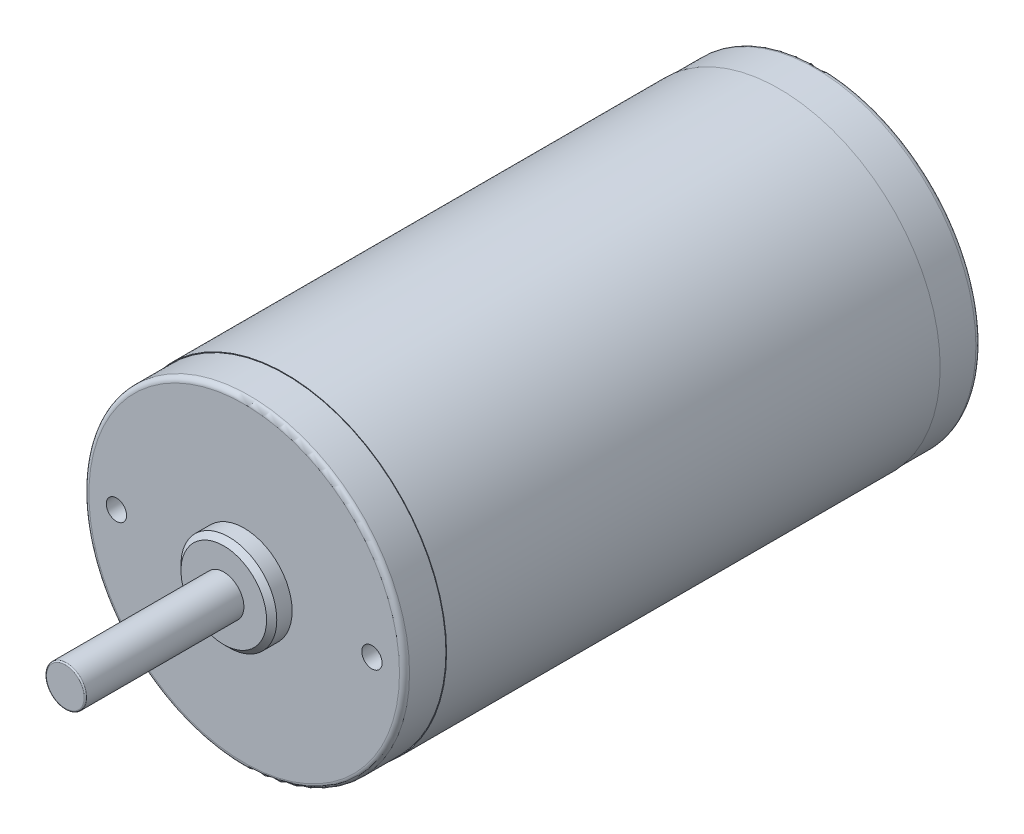
ISO-10303-21;
HEADER;
FILE_DESCRIPTION(('STEP AP214'),'2;1');
FILE_NAME('part.step','',(''),(''),'','','');
FILE_SCHEMA(('AUTOMOTIVE_DESIGN { 1 0 10303 214 1 1 1 1 }'));
ENDSEC;
DATA;
#1=APPLICATION_CONTEXT('core data for automotive mechanical design processes');
#2=APPLICATION_PROTOCOL_DEFINITION('international standard','automotive_design',2000,#1);
#3=PRODUCT_CONTEXT('',#1,'mechanical');
#4=PRODUCT('Part','Part','',(#3));
#5=PRODUCT_RELATED_PRODUCT_CATEGORY('part','',(#4));
#6=PRODUCT_DEFINITION_FORMATION('','',#4);
#7=PRODUCT_DEFINITION_CONTEXT('part definition',#1,'design');
#8=PRODUCT_DEFINITION('design','',#6,#7);
#9=PRODUCT_DEFINITION_SHAPE('','',#8);
#10=(LENGTH_UNIT() NAMED_UNIT(*) SI_UNIT(.MILLI.,.METRE.));
#11=(NAMED_UNIT(*) PLANE_ANGLE_UNIT() SI_UNIT($,.RADIAN.));
#12=(NAMED_UNIT(*) SI_UNIT($,.STERADIAN.) SOLID_ANGLE_UNIT());
#13=UNCERTAINTY_MEASURE_WITH_UNIT(LENGTH_MEASURE(1.E-05),#10,'distance_accuracy_value','');
#14=(GEOMETRIC_REPRESENTATION_CONTEXT(3) GLOBAL_UNCERTAINTY_ASSIGNED_CONTEXT((#13)) GLOBAL_UNIT_ASSIGNED_CONTEXT((#10,
#11,#12)) REPRESENTATION_CONTEXT('',''));
#15=CARTESIAN_POINT('',(0.,0.,0.));
#16=DIRECTION('',(0.,0.,1.));
#17=DIRECTION('',(1.,0.,0.));
#18=AXIS2_PLACEMENT_3D('',#15,#16,#17);
#19=CARTESIAN_POINT('',(35.56,109.2962,-95.554799999998));
#20=DIRECTION('',(0.,0.,-1.));
#21=DIRECTION('',(-1.,0.,0.));
#22=AXIS2_PLACEMENT_3D('',#19,#20,#21);
#23=PLANE('',#22);
#24=CARTESIAN_POINT('',(35.56,109.2962,-95.554799999998));
#25=DIRECTION('',(0.,0.,-1.));
#26=DIRECTION('',(-1.,0.,0.));
#27=AXIS2_PLACEMENT_3D('',#24,#25,#26);
#28=CIRCLE('',#27,30.8770000000005);
#29=CARTESIAN_POINT('',(4.6829999999995,109.2962,-95.554799999998));
#30=VERTEX_POINT('',#29);
#31=EDGE_CURVE('E102',#30,#30,#28,.T.);
#32=ORIENTED_EDGE('',*,*,#31,.T.);
#33=EDGE_LOOP('',(#32));
#34=FACE_BOUND('',#33,.T.);
#35=CARTESIAN_POINT('',(35.56,109.2962,-95.554799999998));
#36=DIRECTION('',(0.,0.,-1.));
#37=DIRECTION('',(-1.,0.,0.));
#38=AXIS2_PLACEMENT_3D('',#35,#36,#37);
#39=CIRCLE('',#38,15.0368000000003);
#40=CARTESIAN_POINT('',(20.5231999999997,109.2962,-95.554799999998));
#41=VERTEX_POINT('',#40);
#42=EDGE_CURVE('E69',#41,#41,#39,.T.);
#43=ORIENTED_EDGE('',*,*,#42,.F.);
#44=EDGE_LOOP('',(#43));
#45=FACE_BOUND('',#44,.T.);
#46=ADVANCED_FACE('F34',(#34,#45),#23,.T.);
#47=CARTESIAN_POINT('',(35.56,109.2962,-87.325199999998));
#48=DIRECTION('',(0.,0.,-1.));
#49=DIRECTION('',(-1.,0.,0.));
#50=AXIS2_PLACEMENT_3D('',#47,#48,#49);
#51=PLANE('',#50);
#52=CARTESIAN_POINT('',(35.56,109.2962,-87.325199999998));
#53=DIRECTION('',(0.,0.,-1.));
#54=DIRECTION('',(-1.,0.,0.));
#55=AXIS2_PLACEMENT_3D('',#52,#53,#54);
#56=CIRCLE('',#55,32.0040000000005);
#57=CARTESIAN_POINT('',(3.5559999999995,109.2962,-87.325199999998));
#58=VERTEX_POINT('',#57);
#59=EDGE_CURVE('E81',#58,#58,#56,.T.);
#60=ORIENTED_EDGE('',*,*,#59,.T.);
#61=EDGE_LOOP('',(#60));
#62=FACE_BOUND('',#61,.T.);
#63=CARTESIAN_POINT('',(35.56,109.2962,-87.325199999998));
#64=DIRECTION('',(0.,0.,-1.));
#65=DIRECTION('',(-1.,0.,0.));
#66=AXIS2_PLACEMENT_3D('',#63,#64,#65);
#67=CIRCLE('',#66,31.8770000000005);
#68=CARTESIAN_POINT('',(3.6829999999995,109.2962,-87.325199999998));
#69=VERTEX_POINT('',#68);
#70=EDGE_CURVE('E72',#69,#69,#67,.T.);
#71=ORIENTED_EDGE('',*,*,#70,.F.);
#72=EDGE_LOOP('',(#71));
#73=FACE_BOUND('',#72,.T.);
#74=ADVANCED_FACE('F128',(#62,#73),#51,.T.);
#75=CARTESIAN_POINT('',(35.56,109.2962,23.114));
#76=DIRECTION('',(0.,0.,1.));
#77=DIRECTION('',(1.,0.,0.));
#78=AXIS2_PLACEMENT_3D('',#75,#76,#77);
#79=PLANE('',#78);
#80=CARTESIAN_POINT('',(35.56,109.2962,23.114));
#81=DIRECTION('',(0.,0.,1.));
#82=DIRECTION('',(1.,0.,0.));
#83=AXIS2_PLACEMENT_3D('',#80,#81,#82);
#84=CIRCLE('',#83,8.50900000182338);
#85=CARTESIAN_POINT('',(44.0690000018234,109.2962,23.114));
#86=VERTEX_POINT('',#85);
#87=EDGE_CURVE('E93',#86,#86,#84,.T.);
#88=ORIENTED_EDGE('',*,*,#87,.T.);
#89=EDGE_LOOP('',(#88));
#90=FACE_BOUND('',#89,.T.);
#91=CARTESIAN_POINT('',(35.56,109.2962,23.114));
#92=DIRECTION('',(0.,0.,1.));
#93=DIRECTION('',(1.,0.,0.));
#94=AXIS2_PLACEMENT_3D('',#91,#92,#93);
#95=CIRCLE('',#94,4.00000000000007);
#96=CARTESIAN_POINT('',(39.5600000000001,109.2962,23.114));
#97=VERTEX_POINT('',#96);
#98=EDGE_CURVE('E75',#97,#97,#95,.T.);
#99=ORIENTED_EDGE('',*,*,#98,.F.);
#100=EDGE_LOOP('',(#99));
#101=FACE_BOUND('',#100,.T.);
#102=ADVANCED_FACE('F134',(#90,#101),#79,.T.);
#103=CARTESIAN_POINT('',(67.5640000000005,109.2962,10.8204000000007));
#104=DIRECTION('',(0.,0.,1.));
#105=DIRECTION('',(1.,0.,0.));
#106=AXIS2_PLACEMENT_3D('',#103,#104,#105);
#107=PLANE('',#106);
#108=CARTESIAN_POINT('',(35.56,109.2962,10.8204000000007));
#109=DIRECTION('',(0.,0.,-1.));
#110=DIRECTION('',(-1.,0.,0.));
#111=AXIS2_PLACEMENT_3D('',#108,#109,#110);
#112=CIRCLE('',#111,32.0040000000005);
#113=CARTESIAN_POINT('',(3.5559999999995,109.2962,10.8204000000007));
#114=VERTEX_POINT('',#113);
#115=EDGE_CURVE('E84',#114,#114,#112,.T.);
#116=ORIENTED_EDGE('',*,*,#115,.F.);
#117=EDGE_LOOP('',(#116));
#118=FACE_BOUND('',#117,.T.);
#119=CARTESIAN_POINT('',(35.56,109.2962,10.8204000000007));
#120=DIRECTION('',(0.,0.,1.));
#121=DIRECTION('',(1.,0.,0.));
#122=AXIS2_PLACEMENT_3D('',#119,#120,#121);
#123=CIRCLE('',#122,31.8770000000005);
#124=CARTESIAN_POINT('',(67.4370000000005,109.2962,10.8204000000007));
#125=VERTEX_POINT('',#124);
#126=EDGE_CURVE('E78',#125,#125,#123,.T.);
#127=ORIENTED_EDGE('',*,*,#126,.F.);
#128=EDGE_LOOP('',(#127));
#129=FACE_BOUND('',#128,.T.);
#130=ADVANCED_FACE('F157',(#118,#129),#107,.T.);
#131=CARTESIAN_POINT('',(35.56,109.2962,10.8204000000007));
#132=DIRECTION('',(0.,0.,-1.));
#133=DIRECTION('',(-1.,0.,0.));
#134=AXIS2_PLACEMENT_3D('',#131,#132,#133);
#135=CYLINDRICAL_SURFACE('',#134,32.0040000000005);
#136=ORIENTED_EDGE('',*,*,#115,.T.);
#137=EDGE_LOOP('',(#136));
#138=FACE_BOUND('',#137,.T.);
#139=ORIENTED_EDGE('',*,*,#59,.F.);
#140=EDGE_LOOP('',(#139));
#141=FACE_BOUND('',#140,.T.);
#142=ADVANCED_FACE('F168',(#138,#141),#135,.T.);
#143=CARTESIAN_POINT('',(35.56,109.2962,19.05));
#144=DIRECTION('',(0.,0.,-1.));
#145=DIRECTION('',(-1.,0.,0.));
#146=AXIS2_PLACEMENT_3D('',#143,#144,#145);
#147=CYLINDRICAL_SURFACE('',#146,31.8770000000005);
#148=CARTESIAN_POINT('',(35.56,109.2962,18.05));
#149=DIRECTION('',(0.,0.,1.));
#150=DIRECTION('',(1.,0.,0.));
#151=AXIS2_PLACEMENT_3D('',#148,#149,#150);
#152=CIRCLE('',#151,31.8770000000005);
#153=CARTESIAN_POINT('',(67.4370000000005,109.2962,18.05));
#154=VERTEX_POINT('',#153);
#155=EDGE_CURVE('E111',#154,#154,#152,.F.);
#156=ORIENTED_EDGE('',*,*,#155,.T.);
#157=EDGE_LOOP('',(#156));
#158=FACE_BOUND('',#157,.T.);
#159=ORIENTED_EDGE('',*,*,#126,.T.);
#160=EDGE_LOOP('',(#159));
#161=FACE_BOUND('',#160,.T.);
#162=ADVANCED_FACE('F165',(#158,#161),#147,.T.);
#163=CARTESIAN_POINT('',(35.56,109.2962,19.05));
#164=DIRECTION('',(0.,0.,1.));
#165=DIRECTION('',(1.,0.,0.));
#166=AXIS2_PLACEMENT_3D('',#163,#164,#165);
#167=PLANE('',#166);
#168=CARTESIAN_POINT('',(35.56,109.2962,19.05));
#169=DIRECTION('',(0.,0.,1.));
#170=DIRECTION('',(1.,0.,0.));
#171=AXIS2_PLACEMENT_3D('',#168,#169,#170);
#172=CIRCLE('',#171,30.8770000000005);
#173=CARTESIAN_POINT('',(66.4370000000005,109.2962,19.05));
#174=VERTEX_POINT('',#173);
#175=EDGE_CURVE('E108',#174,#174,#172,.T.);
#176=ORIENTED_EDGE('',*,*,#175,.T.);
#177=EDGE_LOOP('',(#176));
#178=FACE_BOUND('',#177,.T.);
#179=CARTESIAN_POINT('',(10.1599999999994,109.2962,19.05));
#180=DIRECTION('',(0.,0.,1.));
#181=DIRECTION('',(1.,0.,0.));
#182=AXIS2_PLACEMENT_3D('',#179,#180,#181);
#183=CIRCLE('',#182,2.01930000000003);
#184=CARTESIAN_POINT('',(12.1792999999994,109.2962,19.05));
#185=VERTEX_POINT('',#184);
#186=EDGE_CURVE('E59',#185,#185,#183,.T.);
#187=ORIENTED_EDGE('',*,*,#186,.F.);
#188=EDGE_LOOP('',(#187));
#189=FACE_BOUND('',#188,.T.);
#190=CARTESIAN_POINT('',(60.96,109.2962,19.05));
#191=DIRECTION('',(0.,0.,1.));
#192=DIRECTION('',(1.,0.,0.));
#193=AXIS2_PLACEMENT_3D('',#190,#191,#192);
#194=CIRCLE('',#193,2.01930000000003);
#195=CARTESIAN_POINT('',(62.9793,109.2962,19.05));
#196=VERTEX_POINT('',#195);
#197=EDGE_CURVE('E58',#196,#196,#194,.T.);
#198=ORIENTED_EDGE('',*,*,#197,.F.);
#199=EDGE_LOOP('',(#198));
#200=FACE_BOUND('',#199,.T.);
#201=CARTESIAN_POINT('',(35.56,109.2962,19.05));
#202=DIRECTION('',(0.,0.,1.));
#203=DIRECTION('',(1.,0.,0.));
#204=AXIS2_PLACEMENT_3D('',#201,#202,#203);
#205=CIRCLE('',#204,9.52500000000019);
#206=CARTESIAN_POINT('',(45.0850000000002,109.2962,19.05));
#207=VERTEX_POINT('',#206);
#208=EDGE_CURVE('E87',#207,#207,#205,.T.);
#209=ORIENTED_EDGE('',*,*,#208,.F.);
#210=EDGE_LOOP('',(#209));
#211=FACE_BOUND('',#210,.T.);
#212=ADVANCED_FACE('F161',(#178,#189,#200,#211),#167,.T.);
#213=CARTESIAN_POINT('',(35.56,109.2962,23.114));
#214=DIRECTION('',(0.,0.,-1.));
#215=DIRECTION('',(-1.,0.,0.));
#216=AXIS2_PLACEMENT_3D('',#213,#214,#215);
#217=CYLINDRICAL_SURFACE('',#216,9.52500000000019);
#218=CARTESIAN_POINT('',(35.56,109.2962,22.0979999999996));
#219=DIRECTION('',(0.,0.,1.));
#220=DIRECTION('',(1.,0.,0.));
#221=AXIS2_PLACEMENT_3D('',#218,#219,#220);
#222=CIRCLE('',#221,9.52500000000019);
#223=CARTESIAN_POINT('',(45.0850000000002,109.2962,22.0979999999996));
#224=VERTEX_POINT('',#223);
#225=EDGE_CURVE('E90',#224,#224,#222,.F.);
#226=ORIENTED_EDGE('',*,*,#225,.T.);
#227=EDGE_LOOP('',(#226));
#228=FACE_BOUND('',#227,.T.);
#229=ORIENTED_EDGE('',*,*,#208,.T.);
#230=EDGE_LOOP('',(#229));
#231=FACE_BOUND('',#230,.T.);
#232=ADVANCED_FACE('F153',(#228,#231),#217,.T.);
#233=CARTESIAN_POINT('',(35.56,109.2962,54.614));
#234=DIRECTION('',(0.,0.,-1.));
#235=DIRECTION('',(-1.,0.,0.));
#236=AXIS2_PLACEMENT_3D('',#233,#234,#235);
#237=CYLINDRICAL_SURFACE('',#236,4.00000000000007);
#238=CARTESIAN_POINT('',(35.56,109.2962,54.36));
#239=DIRECTION('',(0.,0.,1.));
#240=DIRECTION('',(1.,0.,0.));
#241=AXIS2_PLACEMENT_3D('',#238,#239,#240);
#242=CIRCLE('',#241,4.00000000000007);
#243=CARTESIAN_POINT('',(39.5600000000001,109.2962,54.36));
#244=VERTEX_POINT('',#243);
#245=EDGE_CURVE('E99',#244,#244,#242,.F.);
#246=ORIENTED_EDGE('',*,*,#245,.T.);
#247=EDGE_LOOP('',(#246));
#248=FACE_BOUND('',#247,.T.);
#249=ORIENTED_EDGE('',*,*,#98,.T.);
#250=EDGE_LOOP('',(#249));
#251=FACE_BOUND('',#250,.T.);
#252=ADVANCED_FACE('F149',(#248,#251),#237,.T.);
#253=CARTESIAN_POINT('',(35.56,109.2962,54.614));
#254=DIRECTION('',(0.,0.,1.));
#255=DIRECTION('',(1.,0.,0.));
#256=AXIS2_PLACEMENT_3D('',#253,#254,#255);
#257=PLANE('',#256);
#258=CARTESIAN_POINT('',(35.56,109.2962,54.614));
#259=DIRECTION('',(0.,0.,1.));
#260=DIRECTION('',(1.,0.,0.));
#261=AXIS2_PLACEMENT_3D('',#258,#259,#260);
#262=CIRCLE('',#261,3.74600000000007);
#263=CARTESIAN_POINT('',(39.3060000000001,109.2962,54.614));
#264=VERTEX_POINT('',#263);
#265=EDGE_CURVE('E96',#264,#264,#262,.T.);
#266=ORIENTED_EDGE('',*,*,#265,.T.);
#267=EDGE_LOOP('',(#266));
#268=FACE_BOUND('',#267,.T.);
#269=ADVANCED_FACE('F145',(#268),#257,.T.);
#270=CARTESIAN_POINT('',(35.56,109.2962,-95.554799999998));
#271=DIRECTION('',(0.,0.,1.));
#272=DIRECTION('',(1.,0.,0.));
#273=AXIS2_PLACEMENT_3D('',#270,#271,#272);
#274=CYLINDRICAL_SURFACE('',#273,31.8770000000005);
#275=CARTESIAN_POINT('',(35.56,109.2962,-94.554799999998));
#276=DIRECTION('',(0.,0.,-1.));
#277=DIRECTION('',(-1.,0.,0.));
#278=AXIS2_PLACEMENT_3D('',#275,#276,#277);
#279=CIRCLE('',#278,31.8770000000005);
#280=CARTESIAN_POINT('',(3.6829999999995,109.2962,-94.554799999998));
#281=VERTEX_POINT('',#280);
#282=EDGE_CURVE('E105',#281,#281,#279,.F.);
#283=ORIENTED_EDGE('',*,*,#282,.T.);
#284=EDGE_LOOP('',(#283));
#285=FACE_BOUND('',#284,.T.);
#286=ORIENTED_EDGE('',*,*,#70,.T.);
#287=EDGE_LOOP('',(#286));
#288=FACE_BOUND('',#287,.T.);
#289=ADVANCED_FACE('F142',(#285,#288),#274,.T.);
#290=CARTESIAN_POINT('',(35.56,109.2962,-100.317299999998));
#291=DIRECTION('',(0.,0.,1.));
#292=DIRECTION('',(1.,0.,0.));
#293=AXIS2_PLACEMENT_3D('',#290,#291,#292);
#294=CYLINDRICAL_SURFACE('',#293,15.0368000000003);
#295=CARTESIAN_POINT('',(35.56,109.2962,-99.317299999998));
#296=DIRECTION('',(0.,0.,-1.));
#297=DIRECTION('',(-1.,0.,0.));
#298=AXIS2_PLACEMENT_3D('',#295,#296,#297);
#299=CIRCLE('',#298,15.0368000000003);
#300=CARTESIAN_POINT('',(20.5231999999997,109.2962,-99.317299999998));
#301=VERTEX_POINT('',#300);
#302=EDGE_CURVE('E11',#301,#301,#299,.F.);
#303=ORIENTED_EDGE('',*,*,#302,.T.);
#304=EDGE_LOOP('',(#303));
#305=FACE_BOUND('',#304,.T.);
#306=ORIENTED_EDGE('',*,*,#42,.T.);
#307=EDGE_LOOP('',(#306));
#308=FACE_BOUND('',#307,.T.);
#309=ADVANCED_FACE('F140',(#305,#308),#294,.T.);
#310=CARTESIAN_POINT('',(35.56,109.2962,-100.317299999998));
#311=DIRECTION('',(0.,0.,-1.));
#312=DIRECTION('',(-1.,0.,0.));
#313=AXIS2_PLACEMENT_3D('',#310,#311,#312);
#314=PLANE('',#313);
#315=CARTESIAN_POINT('',(35.56,109.2962,-100.317299999998));
#316=DIRECTION('',(0.,0.,-1.));
#317=DIRECTION('',(-1.,0.,0.));
#318=AXIS2_PLACEMENT_3D('',#315,#316,#317);
#319=CIRCLE('',#318,14.0368000000003);
#320=CARTESIAN_POINT('',(21.5231999999997,109.2962,-100.317299999998));
#321=VERTEX_POINT('',#320);
#322=EDGE_CURVE('E42',#321,#321,#319,.T.);
#323=ORIENTED_EDGE('',*,*,#322,.T.);
#324=EDGE_LOOP('',(#323));
#325=FACE_BOUND('',#324,.T.);
#326=ADVANCED_FACE('F116',(#325),#314,.T.);
#327=CARTESIAN_POINT('',(60.96,109.2962,5.43560000000074));
#328=DIRECTION('',(0.,0.,1.));
#329=DIRECTION('',(1.,0.,0.));
#330=AXIS2_PLACEMENT_3D('',#327,#328,#329);
#331=CONICAL_SURFACE('',#330,2.01930000000003,1.0297442575);
#332=CARTESIAN_POINT('',(60.96,109.2962,4.22228214876452));
#333=VERTEX_POINT('',#332);
#334=VERTEX_LOOP('',#333);
#335=FACE_BOUND('',#334,.T.);
#336=CARTESIAN_POINT('',(60.96,109.2962,5.43560000000074));
#337=DIRECTION('',(0.,0.,1.));
#338=DIRECTION('',(1.,0.,0.));
#339=AXIS2_PLACEMENT_3D('',#336,#337,#338);
#340=CIRCLE('',#339,2.01930000000003);
#341=CARTESIAN_POINT('',(62.9793,109.2962,5.43560000000074));
#342=VERTEX_POINT('',#341);
#343=EDGE_CURVE('E62',#342,#342,#340,.T.);
#344=ORIENTED_EDGE('',*,*,#343,.T.);
#345=EDGE_LOOP('',(#344));
#346=FACE_BOUND('',#345,.T.);
#347=ADVANCED_FACE('F232',(#335,#346),#331,.F.);
#348=CARTESIAN_POINT('',(60.96,109.2962,19.05));
#349=DIRECTION('',(0.,0.,1.));
#350=DIRECTION('',(1.,0.,0.));
#351=AXIS2_PLACEMENT_3D('',#348,#349,#350);
#352=CYLINDRICAL_SURFACE('',#351,2.01930000000003);
#353=ORIENTED_EDGE('',*,*,#343,.F.);
#354=EDGE_LOOP('',(#353));
#355=FACE_BOUND('',#354,.T.);
#356=ORIENTED_EDGE('',*,*,#197,.T.);
#357=EDGE_LOOP('',(#356));
#358=FACE_BOUND('',#357,.T.);
#359=ADVANCED_FACE('F52',(#355,#358),#352,.F.);
#360=CARTESIAN_POINT('',(10.1599999999994,109.2962,5.4356000000007));
#361=DIRECTION('',(0.,0.,1.));
#362=DIRECTION('',(1.,0.,0.));
#363=AXIS2_PLACEMENT_3D('',#360,#361,#362);
#364=CONICAL_SURFACE('',#363,2.01930000000003,1.0297442575);
#365=CARTESIAN_POINT('',(10.1599999999994,109.2962,4.22228214876447));
#366=VERTEX_POINT('',#365);
#367=VERTEX_LOOP('',#366);
#368=FACE_BOUND('',#367,.T.);
#369=CARTESIAN_POINT('',(10.1599999999994,109.2962,5.4356000000007));
#370=DIRECTION('',(0.,0.,1.));
#371=DIRECTION('',(1.,0.,0.));
#372=AXIS2_PLACEMENT_3D('',#369,#370,#371);
#373=CIRCLE('',#372,2.01930000000003);
#374=CARTESIAN_POINT('',(12.1792999999994,109.2962,5.4356000000007));
#375=VERTEX_POINT('',#374);
#376=EDGE_CURVE('E56',#375,#375,#373,.T.);
#377=ORIENTED_EDGE('',*,*,#376,.T.);
#378=EDGE_LOOP('',(#377));
#379=FACE_BOUND('',#378,.T.);
#380=ADVANCED_FACE('F48',(#368,#379),#364,.F.);
#381=CARTESIAN_POINT('',(10.1599999999994,109.2962,19.05));
#382=DIRECTION('',(0.,0.,1.));
#383=DIRECTION('',(1.,0.,0.));
#384=AXIS2_PLACEMENT_3D('',#381,#382,#383);
#385=CYLINDRICAL_SURFACE('',#384,2.01930000000003);
#386=ORIENTED_EDGE('',*,*,#376,.F.);
#387=EDGE_LOOP('',(#386));
#388=FACE_BOUND('',#387,.T.);
#389=ORIENTED_EDGE('',*,*,#186,.T.);
#390=EDGE_LOOP('',(#389));
#391=FACE_BOUND('',#390,.T.);
#392=ADVANCED_FACE('F51',(#388,#391),#385,.F.);
#393=CARTESIAN_POINT('',(35.56,109.2962,22.0979999999996));
#394=DIRECTION('',(0.,0.,-1.));
#395=DIRECTION('',(-1.,0.,0.));
#396=AXIS2_PLACEMENT_3D('',#393,#394,#395);
#397=CONICAL_SURFACE('',#396,9.52500000000019,0.785398162500005);
#398=ORIENTED_EDGE('',*,*,#87,.F.);
#399=EDGE_LOOP('',(#398));
#400=FACE_BOUND('',#399,.T.);
#401=ORIENTED_EDGE('',*,*,#225,.F.);
#402=EDGE_LOOP('',(#401));
#403=FACE_BOUND('',#402,.T.);
#404=ADVANCED_FACE('F177',(#400,#403),#397,.T.);
#405=CARTESIAN_POINT('',(35.56,109.2962,54.36));
#406=DIRECTION('',(0.,0.,1.));
#407=DIRECTION('',(1.,0.,0.));
#408=AXIS2_PLACEMENT_3D('',#405,#406,#407);
#409=TOROIDAL_SURFACE('',#408,3.74600000000007,0.254);
#410=ORIENTED_EDGE('',*,*,#245,.F.);
#411=EDGE_LOOP('',(#410));
#412=FACE_BOUND('',#411,.T.);
#413=ORIENTED_EDGE('',*,*,#265,.F.);
#414=EDGE_LOOP('',(#413));
#415=FACE_BOUND('',#414,.T.);
#416=ADVANCED_FACE('F180',(#412,#415),#409,.T.);
#417=CARTESIAN_POINT('',(35.56,109.2962,-94.554799999998));
#418=DIRECTION('',(0.,0.,-1.));
#419=DIRECTION('',(-1.,0.,0.));
#420=AXIS2_PLACEMENT_3D('',#417,#418,#419);
#421=TOROIDAL_SURFACE('',#420,30.8770000000005,1.);
#422=ORIENTED_EDGE('',*,*,#282,.F.);
#423=EDGE_LOOP('',(#422));
#424=FACE_BOUND('',#423,.T.);
#425=ORIENTED_EDGE('',*,*,#31,.F.);
#426=EDGE_LOOP('',(#425));
#427=FACE_BOUND('',#426,.T.);
#428=ADVANCED_FACE('F124',(#424,#427),#421,.T.);
#429=CARTESIAN_POINT('',(35.56,109.2962,18.05));
#430=DIRECTION('',(0.,0.,1.));
#431=DIRECTION('',(1.,0.,0.));
#432=AXIS2_PLACEMENT_3D('',#429,#430,#431);
#433=TOROIDAL_SURFACE('',#432,30.8770000000005,1.);
#434=ORIENTED_EDGE('',*,*,#155,.F.);
#435=EDGE_LOOP('',(#434));
#436=FACE_BOUND('',#435,.T.);
#437=ORIENTED_EDGE('',*,*,#175,.F.);
#438=EDGE_LOOP('',(#437));
#439=FACE_BOUND('',#438,.T.);
#440=ADVANCED_FACE('F119',(#436,#439),#433,.T.);
#441=CARTESIAN_POINT('',(35.56,109.2962,-99.317299999998));
#442=DIRECTION('',(0.,0.,-1.));
#443=DIRECTION('',(-1.,0.,0.));
#444=AXIS2_PLACEMENT_3D('',#441,#442,#443);
#445=TOROIDAL_SURFACE('',#444,14.0368000000003,1.);
#446=ORIENTED_EDGE('',*,*,#302,.F.);
#447=EDGE_LOOP('',(#446));
#448=FACE_BOUND('',#447,.T.);
#449=ORIENTED_EDGE('',*,*,#322,.F.);
#450=EDGE_LOOP('',(#449));
#451=FACE_BOUND('',#450,.T.);
#452=ADVANCED_FACE('F36',(#448,#451),#445,.T.);
#453=CLOSED_SHELL('',(#46,#74,#102,#130,#142,#162,#212,#232,#252,#269,#289,#309,#326,#347,#359,
#380,#392,#404,#416,#428,#440,#452));
#454=MANIFOLD_SOLID_BREP('B2',#453);
#455=ADVANCED_BREP_SHAPE_REPRESENTATION('',(#18,#454),#14);
#456=SHAPE_DEFINITION_REPRESENTATION(#9,#455);
ENDSEC;
END-ISO-10303-21;
